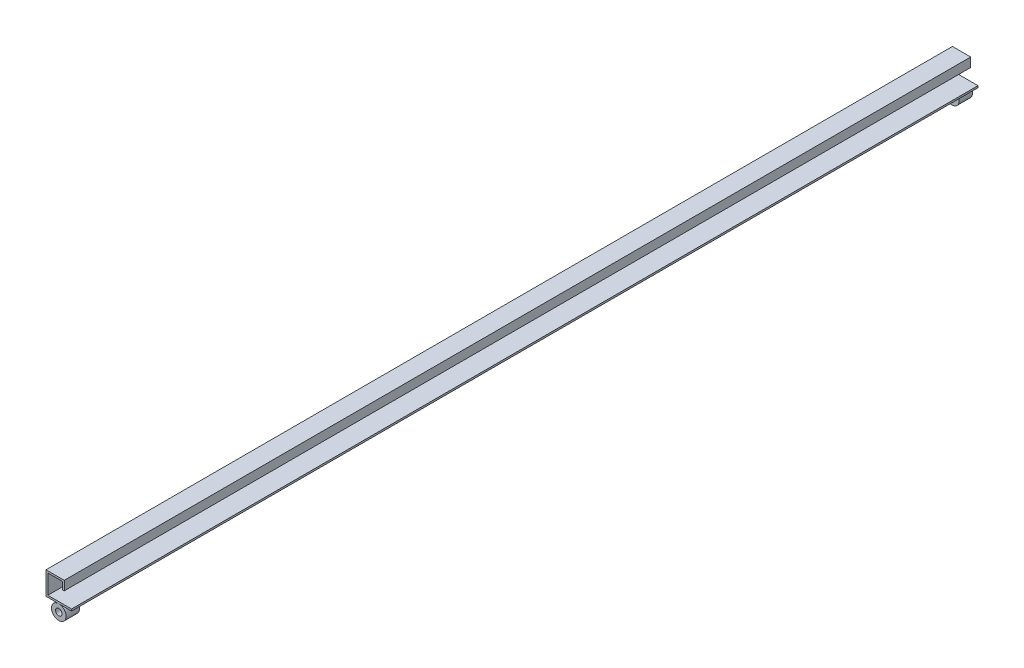
ISO-10303-21;
HEADER;
FILE_DESCRIPTION(('STEP AP214'),'2;1');
FILE_NAME('part.step','',(''),(''),'','','');
FILE_SCHEMA(('AUTOMOTIVE_DESIGN { 1 0 10303 214 1 1 1 1 }'));
ENDSEC;
DATA;
#1=APPLICATION_CONTEXT('core data for automotive mechanical design processes');
#2=APPLICATION_PROTOCOL_DEFINITION('international standard','automotive_design',2000,#1);
#3=PRODUCT_CONTEXT('',#1,'mechanical');
#4=PRODUCT('Part','Part','',(#3));
#5=PRODUCT_RELATED_PRODUCT_CATEGORY('part','',(#4));
#6=PRODUCT_DEFINITION_FORMATION('','',#4);
#7=PRODUCT_DEFINITION_CONTEXT('part definition',#1,'design');
#8=PRODUCT_DEFINITION('design','',#6,#7);
#9=PRODUCT_DEFINITION_SHAPE('','',#8);
#10=(LENGTH_UNIT() NAMED_UNIT(*) SI_UNIT(.MILLI.,.METRE.));
#11=(NAMED_UNIT(*) PLANE_ANGLE_UNIT() SI_UNIT($,.RADIAN.));
#12=(NAMED_UNIT(*) SI_UNIT($,.STERADIAN.) SOLID_ANGLE_UNIT());
#13=UNCERTAINTY_MEASURE_WITH_UNIT(LENGTH_MEASURE(1.E-05),#10,'distance_accuracy_value','');
#14=(GEOMETRIC_REPRESENTATION_CONTEXT(3) GLOBAL_UNCERTAINTY_ASSIGNED_CONTEXT((#13)) GLOBAL_UNIT_ASSIGNED_CONTEXT((#10,
#11,#12)) REPRESENTATION_CONTEXT('',''));
#15=CARTESIAN_POINT('',(0.,0.,0.));
#16=DIRECTION('',(0.,0.,1.));
#17=DIRECTION('',(1.,0.,0.));
#18=AXIS2_PLACEMENT_3D('',#15,#16,#17);
#19=CARTESIAN_POINT('',(-14.,-8.,978.4));
#20=DIRECTION('',(0.,0.,1.));
#21=DIRECTION('',(-1.,0.,0.));
#22=AXIS2_PLACEMENT_3D('',#19,#20,#21);
#23=CYLINDRICAL_SURFACE('',#22,8.);
#24=CARTESIAN_POINT('',(-14.,-8.,978.4));
#25=DIRECTION('',(0.,0.,-1.));
#26=DIRECTION('',(-1.,0.,0.));
#27=AXIS2_PLACEMENT_3D('',#24,#25,#26);
#28=CIRCLE('',#27,8.);
#29=CARTESIAN_POINT('',(-22.,-8.,978.4));
#30=VERTEX_POINT('',#29);
#31=EDGE_CURVE('E11',#30,#30,#28,.T.);
#32=ORIENTED_EDGE('',*,*,#31,.F.);
#33=EDGE_LOOP('',(#32));
#34=FACE_BOUND('',#33,.T.);
#35=CARTESIAN_POINT('',(-14.,-8.,993.));
#36=DIRECTION('',(0.,0.,-1.));
#37=DIRECTION('',(-1.,0.,0.));
#38=AXIS2_PLACEMENT_3D('',#35,#36,#37);
#39=CIRCLE('',#38,8.);
#40=CARTESIAN_POINT('',(-22.,-8.,993.));
#41=VERTEX_POINT('',#40);
#42=EDGE_CURVE('E46',#41,#41,#39,.T.);
#43=ORIENTED_EDGE('',*,*,#42,.T.);
#44=EDGE_LOOP('',(#43));
#45=FACE_BOUND('',#44,.T.);
#46=ADVANCED_FACE('F43',(#34,#45),#23,.T.);
#47=CARTESIAN_POINT('',(-14.,-8.,978.4));
#48=DIRECTION('',(0.,0.,1.));
#49=DIRECTION('',(-1.,0.,0.));
#50=AXIS2_PLACEMENT_3D('',#47,#48,#49);
#51=PLANE('',#50);
#52=CARTESIAN_POINT('',(-14.,-8.,978.4));
#53=DIRECTION('',(0.,0.,-1.));
#54=DIRECTION('',(-1.,0.,0.));
#55=AXIS2_PLACEMENT_3D('',#52,#53,#54);
#56=CIRCLE('',#55,3.5);
#57=CARTESIAN_POINT('',(-17.5,-8.,978.4));
#58=VERTEX_POINT('',#57);
#59=EDGE_CURVE('E53',#58,#58,#56,.T.);
#60=ORIENTED_EDGE('',*,*,#59,.F.);
#61=EDGE_LOOP('',(#60));
#62=FACE_BOUND('',#61,.T.);
#63=ORIENTED_EDGE('',*,*,#31,.T.);
#64=EDGE_LOOP('',(#63));
#65=FACE_BOUND('',#64,.T.);
#66=ADVANCED_FACE('F64',(#62,#65),#51,.F.);
#67=CARTESIAN_POINT('',(-14.,-8.,993.));
#68=DIRECTION('',(0.,0.,1.));
#69=DIRECTION('',(-1.,0.,0.));
#70=AXIS2_PLACEMENT_3D('',#67,#68,#69);
#71=PLANE('',#70);
#72=CARTESIAN_POINT('',(-14.,-8.,993.));
#73=DIRECTION('',(0.,0.,-1.));
#74=DIRECTION('',(-1.,0.,0.));
#75=AXIS2_PLACEMENT_3D('',#72,#73,#74);
#76=CIRCLE('',#75,3.5);
#77=CARTESIAN_POINT('',(-17.5,-8.,993.));
#78=VERTEX_POINT('',#77);
#79=EDGE_CURVE('E55',#78,#78,#76,.T.);
#80=ORIENTED_EDGE('',*,*,#79,.T.);
#81=EDGE_LOOP('',(#80));
#82=FACE_BOUND('',#81,.T.);
#83=ORIENTED_EDGE('',*,*,#42,.F.);
#84=EDGE_LOOP('',(#83));
#85=FACE_BOUND('',#84,.T.);
#86=ADVANCED_FACE('F66',(#82,#85),#71,.T.);
#87=CARTESIAN_POINT('',(-14.,-8.,978.4));
#88=DIRECTION('',(0.,0.,1.));
#89=DIRECTION('',(-1.,0.,0.));
#90=AXIS2_PLACEMENT_3D('',#87,#88,#89);
#91=CYLINDRICAL_SURFACE('',#90,3.5);
#92=ORIENTED_EDGE('',*,*,#59,.T.);
#93=EDGE_LOOP('',(#92));
#94=FACE_BOUND('',#93,.T.);
#95=ORIENTED_EDGE('',*,*,#79,.F.);
#96=EDGE_LOOP('',(#95));
#97=FACE_BOUND('',#96,.T.);
#98=ADVANCED_FACE('F61',(#94,#97),#91,.F.);
#99=CLOSED_SHELL('',(#46,#66,#86,#98));
#100=MANIFOLD_SOLID_BREP('B2',#99);
#101=CARTESIAN_POINT('',(-14.,-8.,14.6));
#102=DIRECTION('',(0.,0.,-1.));
#103=DIRECTION('',(-1.,0.,0.));
#104=AXIS2_PLACEMENT_3D('',#101,#102,#103);
#105=CYLINDRICAL_SURFACE('',#104,8.);
#106=CARTESIAN_POINT('',(-14.,-8.,14.6));
#107=DIRECTION('',(0.,0.,-1.));
#108=DIRECTION('',(-1.,0.,0.));
#109=AXIS2_PLACEMENT_3D('',#106,#107,#108);
#110=CIRCLE('',#109,8.);
#111=CARTESIAN_POINT('',(-22.,-8.,14.6));
#112=VERTEX_POINT('',#111);
#113=EDGE_CURVE('E42',#112,#112,#110,.T.);
#114=ORIENTED_EDGE('',*,*,#113,.T.);
#115=EDGE_LOOP('',(#114));
#116=FACE_BOUND('',#115,.T.);
#117=CARTESIAN_POINT('',(-14.,-8.,0.));
#118=DIRECTION('',(0.,0.,-1.));
#119=DIRECTION('',(-1.,0.,0.));
#120=AXIS2_PLACEMENT_3D('',#117,#118,#119);
#121=CIRCLE('',#120,8.);
#122=CARTESIAN_POINT('',(-22.,-8.,0.));
#123=VERTEX_POINT('',#122);
#124=EDGE_CURVE('E124',#123,#123,#121,.T.);
#125=ORIENTED_EDGE('',*,*,#124,.F.);
#126=EDGE_LOOP('',(#125));
#127=FACE_BOUND('',#126,.T.);
#128=ADVANCED_FACE('F121',(#116,#127),#105,.T.);
#129=CARTESIAN_POINT('',(-14.,-8.,14.6));
#130=DIRECTION('',(0.,0.,-1.));
#131=DIRECTION('',(-1.,0.,0.));
#132=AXIS2_PLACEMENT_3D('',#129,#130,#131);
#133=PLANE('',#132);
#134=CARTESIAN_POINT('',(-14.,-8.,14.6));
#135=DIRECTION('',(0.,0.,-1.));
#136=DIRECTION('',(-1.,0.,0.));
#137=AXIS2_PLACEMENT_3D('',#134,#135,#136);
#138=CIRCLE('',#137,3.5);
#139=CARTESIAN_POINT('',(-17.5,-8.,14.6));
#140=VERTEX_POINT('',#139);
#141=EDGE_CURVE('E131',#140,#140,#138,.T.);
#142=ORIENTED_EDGE('',*,*,#141,.T.);
#143=EDGE_LOOP('',(#142));
#144=FACE_BOUND('',#143,.T.);
#145=ORIENTED_EDGE('',*,*,#113,.F.);
#146=EDGE_LOOP('',(#145));
#147=FACE_BOUND('',#146,.T.);
#148=ADVANCED_FACE('F139',(#144,#147),#133,.F.);
#149=CARTESIAN_POINT('',(-14.,-8.,0.));
#150=DIRECTION('',(0.,0.,-1.));
#151=DIRECTION('',(-1.,0.,0.));
#152=AXIS2_PLACEMENT_3D('',#149,#150,#151);
#153=PLANE('',#152);
#154=CARTESIAN_POINT('',(-14.,-8.,0.));
#155=DIRECTION('',(0.,0.,-1.));
#156=DIRECTION('',(-1.,0.,0.));
#157=AXIS2_PLACEMENT_3D('',#154,#155,#156);
#158=CIRCLE('',#157,3.5);
#159=CARTESIAN_POINT('',(-17.5,-8.,0.));
#160=VERTEX_POINT('',#159);
#161=EDGE_CURVE('E133',#160,#160,#158,.T.);
#162=ORIENTED_EDGE('',*,*,#161,.F.);
#163=EDGE_LOOP('',(#162));
#164=FACE_BOUND('',#163,.T.);
#165=ORIENTED_EDGE('',*,*,#124,.T.);
#166=EDGE_LOOP('',(#165));
#167=FACE_BOUND('',#166,.T.);
#168=ADVANCED_FACE('F145',(#164,#167),#153,.T.);
#169=CARTESIAN_POINT('',(-14.,-8.,14.6));
#170=DIRECTION('',(0.,0.,-1.));
#171=DIRECTION('',(-1.,0.,0.));
#172=AXIS2_PLACEMENT_3D('',#169,#170,#171);
#173=CYLINDRICAL_SURFACE('',#172,3.5);
#174=ORIENTED_EDGE('',*,*,#141,.F.);
#175=EDGE_LOOP('',(#174));
#176=FACE_BOUND('',#175,.T.);
#177=ORIENTED_EDGE('',*,*,#161,.T.);
#178=EDGE_LOOP('',(#177));
#179=FACE_BOUND('',#178,.T.);
#180=ADVANCED_FACE('F142',(#176,#179),#173,.F.);
#181=CLOSED_SHELL('',(#128,#148,#168,#180));
#182=MANIFOLD_SOLID_BREP('B6',#181);
#183=CARTESIAN_POINT('',(0.,2.,993.));
#184=DIRECTION('',(-1.,0.,0.));
#185=DIRECTION('',(0.,0.,1.));
#186=AXIS2_PLACEMENT_3D('',#183,#184,#185);
#187=PLANE('',#186);
#188=DIRECTION('',(0.,1.,0.));
#189=VECTOR('',#188,1.);
#190=CARTESIAN_POINT('',(0.,2.,0.));
#191=LINE('',#190,#189);
#192=CARTESIAN_POINT('',(0.,0.,0.));
#193=VERTEX_POINT('',#192);
#194=CARTESIAN_POINT('',(0.,2.,0.));
#195=VERTEX_POINT('',#194);
#196=EDGE_CURVE('E298',#193,#195,#191,.T.);
#197=ORIENTED_EDGE('',*,*,#196,.T.);
#198=DIRECTION('',(0.,0.,-1.));
#199=VECTOR('',#198,1.);
#200=CARTESIAN_POINT('',(0.,2.,993.));
#201=LINE('',#200,#199);
#202=CARTESIAN_POINT('',(0.,2.,993.));
#203=VERTEX_POINT('',#202);
#204=EDGE_CURVE('E119',#203,#195,#201,.T.);
#205=ORIENTED_EDGE('',*,*,#204,.F.);
#206=DIRECTION('',(0.,1.,0.));
#207=VECTOR('',#206,1.);
#208=CARTESIAN_POINT('',(0.,2.,993.));
#209=LINE('',#208,#207);
#210=CARTESIAN_POINT('',(0.,0.,993.));
#211=VERTEX_POINT('',#210);
#212=EDGE_CURVE('E316',#211,#203,#209,.T.);
#213=ORIENTED_EDGE('',*,*,#212,.F.);
#214=DIRECTION('',(0.,0.,-1.));
#215=VECTOR('',#214,1.);
#216=CARTESIAN_POINT('',(0.,0.,993.));
#217=LINE('',#216,#215);
#218=EDGE_CURVE('E294',#211,#193,#217,.T.);
#219=ORIENTED_EDGE('',*,*,#218,.T.);
#220=EDGE_LOOP('',(#197,#205,#213,#219));
#221=FACE_BOUND('',#220,.T.);
#222=ADVANCED_FACE('F190',(#221),#187,.F.);
#223=CARTESIAN_POINT('',(0.,2.,993.));
#224=DIRECTION('',(0.,-1.,0.));
#225=DIRECTION('',(0.,0.,-1.));
#226=AXIS2_PLACEMENT_3D('',#223,#224,#225);
#227=PLANE('',#226);
#228=DIRECTION('',(-1.,0.,0.));
#229=VECTOR('',#228,1.);
#230=CARTESIAN_POINT('',(0.,2.,0.));
#231=LINE('',#230,#229);
#232=CARTESIAN_POINT('',(-26.,2.,0.));
#233=VERTEX_POINT('',#232);
#234=EDGE_CURVE('E301',#195,#233,#231,.T.);
#235=ORIENTED_EDGE('',*,*,#234,.T.);
#236=DIRECTION('',(0.,0.,-1.));
#237=VECTOR('',#236,1.);
#238=CARTESIAN_POINT('',(-26.,2.,993.));
#239=LINE('',#238,#237);
#240=CARTESIAN_POINT('',(-26.,2.,993.));
#241=VERTEX_POINT('',#240);
#242=EDGE_CURVE('E198',#241,#233,#239,.T.);
#243=ORIENTED_EDGE('',*,*,#242,.F.);
#244=DIRECTION('',(-1.,0.,0.));
#245=VECTOR('',#244,1.);
#246=CARTESIAN_POINT('',(0.,2.,993.));
#247=LINE('',#246,#245);
#248=EDGE_CURVE('E255',#203,#241,#247,.T.);
#249=ORIENTED_EDGE('',*,*,#248,.F.);
#250=ORIENTED_EDGE('',*,*,#204,.T.);
#251=EDGE_LOOP('',(#235,#243,#249,#250));
#252=FACE_BOUND('',#251,.T.);
#253=ADVANCED_FACE('F365',(#252),#227,.F.);
#254=CARTESIAN_POINT('',(-26.,2.,993.));
#255=DIRECTION('',(-1.,0.,0.));
#256=DIRECTION('',(0.,0.,1.));
#257=AXIS2_PLACEMENT_3D('',#254,#255,#256);
#258=PLANE('',#257);
#259=DIRECTION('',(0.,1.,0.));
#260=VECTOR('',#259,1.);
#261=CARTESIAN_POINT('',(-26.,2.,0.));
#262=LINE('',#261,#260);
#263=CARTESIAN_POINT('',(-26.,23.2,0.));
#264=VERTEX_POINT('',#263);
#265=EDGE_CURVE('E303',#233,#264,#262,.T.);
#266=ORIENTED_EDGE('',*,*,#265,.T.);
#267=DIRECTION('',(0.,0.,-1.));
#268=VECTOR('',#267,1.);
#269=CARTESIAN_POINT('',(-26.,23.2,993.));
#270=LINE('',#269,#268);
#271=CARTESIAN_POINT('',(-26.,23.2,993.));
#272=VERTEX_POINT('',#271);
#273=EDGE_CURVE('E329',#272,#264,#270,.T.);
#274=ORIENTED_EDGE('',*,*,#273,.F.);
#275=DIRECTION('',(0.,1.,0.));
#276=VECTOR('',#275,1.);
#277=CARTESIAN_POINT('',(-26.,2.,993.));
#278=LINE('',#277,#276);
#279=EDGE_CURVE('E337',#241,#272,#278,.T.);
#280=ORIENTED_EDGE('',*,*,#279,.F.);
#281=ORIENTED_EDGE('',*,*,#242,.T.);
#282=EDGE_LOOP('',(#266,#274,#280,#281));
#283=FACE_BOUND('',#282,.T.);
#284=ADVANCED_FACE('F335',(#283),#258,.F.);
#285=CARTESIAN_POINT('',(-26.,23.2,993.));
#286=DIRECTION('',(0.,1.,0.));
#287=DIRECTION('',(0.,0.,1.));
#288=AXIS2_PLACEMENT_3D('',#285,#286,#287);
#289=PLANE('',#288);
#290=DIRECTION('',(1.,0.,0.));
#291=VECTOR('',#290,1.);
#292=CARTESIAN_POINT('',(-26.,23.2,0.));
#293=LINE('',#292,#291);
#294=CARTESIAN_POINT('',(-10.,23.2,0.));
#295=VERTEX_POINT('',#294);
#296=EDGE_CURVE('E305',#264,#295,#293,.T.);
#297=ORIENTED_EDGE('',*,*,#296,.T.);
#298=DIRECTION('',(0.,0.,-1.));
#299=VECTOR('',#298,1.);
#300=CARTESIAN_POINT('',(-10.,23.2,993.));
#301=LINE('',#300,#299);
#302=CARTESIAN_POINT('',(-10.,23.2,993.));
#303=VERTEX_POINT('',#302);
#304=EDGE_CURVE('E326',#303,#295,#301,.T.);
#305=ORIENTED_EDGE('',*,*,#304,.F.);
#306=DIRECTION('',(1.,0.,0.));
#307=VECTOR('',#306,1.);
#308=CARTESIAN_POINT('',(-26.,23.2,993.));
#309=LINE('',#308,#307);
#310=EDGE_CURVE('E355',#272,#303,#309,.T.);
#311=ORIENTED_EDGE('',*,*,#310,.F.);
#312=ORIENTED_EDGE('',*,*,#273,.T.);
#313=EDGE_LOOP('',(#297,#305,#311,#312));
#314=FACE_BOUND('',#313,.T.);
#315=ADVANCED_FACE('F346',(#314),#289,.F.);
#316=CARTESIAN_POINT('',(-10.,23.2,993.));
#317=DIRECTION('',(1.,0.,0.));
#318=DIRECTION('',(0.,0.,-1.));
#319=AXIS2_PLACEMENT_3D('',#316,#317,#318);
#320=PLANE('',#319);
#321=DIRECTION('',(0.,-1.,0.));
#322=VECTOR('',#321,1.);
#323=CARTESIAN_POINT('',(-10.,23.2,0.));
#324=LINE('',#323,#322);
#325=CARTESIAN_POINT('',(-10.,15.2,0.));
#326=VERTEX_POINT('',#325);
#327=EDGE_CURVE('E307',#295,#326,#324,.T.);
#328=ORIENTED_EDGE('',*,*,#327,.T.);
#329=DIRECTION('',(0.,0.,-1.));
#330=VECTOR('',#329,1.);
#331=CARTESIAN_POINT('',(-10.,15.2,993.));
#332=LINE('',#331,#330);
#333=CARTESIAN_POINT('',(-10.,15.2,993.));
#334=VERTEX_POINT('',#333);
#335=EDGE_CURVE('E323',#334,#326,#332,.T.);
#336=ORIENTED_EDGE('',*,*,#335,.F.);
#337=DIRECTION('',(0.,-1.,0.));
#338=VECTOR('',#337,1.);
#339=CARTESIAN_POINT('',(-10.,23.2,993.));
#340=LINE('',#339,#338);
#341=EDGE_CURVE('E352',#303,#334,#340,.T.);
#342=ORIENTED_EDGE('',*,*,#341,.F.);
#343=ORIENTED_EDGE('',*,*,#304,.T.);
#344=EDGE_LOOP('',(#328,#336,#342,#343));
#345=FACE_BOUND('',#344,.T.);
#346=ADVANCED_FACE('F350',(#345),#320,.F.);
#347=CARTESIAN_POINT('',(-10.,15.2,993.));
#348=DIRECTION('',(0.,1.,0.));
#349=DIRECTION('',(0.,0.,1.));
#350=AXIS2_PLACEMENT_3D('',#347,#348,#349);
#351=PLANE('',#350);
#352=DIRECTION('',(1.,0.,0.));
#353=VECTOR('',#352,1.);
#354=CARTESIAN_POINT('',(-10.,15.2,0.));
#355=LINE('',#354,#353);
#356=CARTESIAN_POINT('',(-8.,15.2,0.));
#357=VERTEX_POINT('',#356);
#358=EDGE_CURVE('E309',#326,#357,#355,.T.);
#359=ORIENTED_EDGE('',*,*,#358,.T.);
#360=DIRECTION('',(0.,0.,-1.));
#361=VECTOR('',#360,1.);
#362=CARTESIAN_POINT('',(-8.,15.2,993.));
#363=LINE('',#362,#361);
#364=CARTESIAN_POINT('',(-8.,15.2,993.));
#365=VERTEX_POINT('',#364);
#366=EDGE_CURVE('E320',#365,#357,#363,.T.);
#367=ORIENTED_EDGE('',*,*,#366,.F.);
#368=DIRECTION('',(1.,0.,0.));
#369=VECTOR('',#368,1.);
#370=CARTESIAN_POINT('',(-10.,15.2,993.));
#371=LINE('',#370,#369);
#372=EDGE_CURVE('E354',#334,#365,#371,.T.);
#373=ORIENTED_EDGE('',*,*,#372,.F.);
#374=ORIENTED_EDGE('',*,*,#335,.T.);
#375=EDGE_LOOP('',(#359,#367,#373,#374));
#376=FACE_BOUND('',#375,.T.);
#377=ADVANCED_FACE('F377',(#376),#351,.F.);
#378=CARTESIAN_POINT('',(-8.,25.2,993.));
#379=DIRECTION('',(-1.,0.,0.));
#380=DIRECTION('',(0.,-1.,0.));
#381=AXIS2_PLACEMENT_3D('',#378,#379,#380);
#382=PLANE('',#381);
#383=DIRECTION('',(0.,1.,0.));
#384=VECTOR('',#383,1.);
#385=CARTESIAN_POINT('',(-8.,25.2,0.));
#386=LINE('',#385,#384);
#387=CARTESIAN_POINT('',(-8.,25.2,0.));
#388=VERTEX_POINT('',#387);
#389=EDGE_CURVE('E311',#357,#388,#386,.T.);
#390=ORIENTED_EDGE('',*,*,#389,.T.);
#391=DIRECTION('',(0.,0.,-1.));
#392=VECTOR('',#391,1.);
#393=CARTESIAN_POINT('',(-8.,25.2,993.));
#394=LINE('',#393,#392);
#395=CARTESIAN_POINT('',(-8.,25.2,993.));
#396=VERTEX_POINT('',#395);
#397=EDGE_CURVE('E289',#396,#388,#394,.T.);
#398=ORIENTED_EDGE('',*,*,#397,.F.);
#399=DIRECTION('',(0.,1.,0.));
#400=VECTOR('',#399,1.);
#401=CARTESIAN_POINT('',(-8.,25.2,993.));
#402=LINE('',#401,#400);
#403=EDGE_CURVE('E280',#365,#396,#402,.T.);
#404=ORIENTED_EDGE('',*,*,#403,.F.);
#405=ORIENTED_EDGE('',*,*,#366,.T.);
#406=EDGE_LOOP('',(#390,#398,#404,#405));
#407=FACE_BOUND('',#406,.T.);
#408=ADVANCED_FACE('F380',(#407),#382,.F.);
#409=CARTESIAN_POINT('',(-28.,25.2,993.));
#410=DIRECTION('',(0.,-1.,0.));
#411=DIRECTION('',(0.,0.,-1.));
#412=AXIS2_PLACEMENT_3D('',#409,#410,#411);
#413=PLANE('',#412);
#414=DIRECTION('',(-1.,0.,0.));
#415=VECTOR('',#414,1.);
#416=CARTESIAN_POINT('',(-28.,25.2,0.));
#417=LINE('',#416,#415);
#418=CARTESIAN_POINT('',(-28.,25.2,0.));
#419=VERTEX_POINT('',#418);
#420=EDGE_CURVE('E288',#388,#419,#417,.T.);
#421=ORIENTED_EDGE('',*,*,#420,.T.);
#422=DIRECTION('',(0.,0.,-1.));
#423=VECTOR('',#422,1.);
#424=CARTESIAN_POINT('',(-28.,25.2,993.));
#425=LINE('',#424,#423);
#426=CARTESIAN_POINT('',(-28.,25.2,993.));
#427=VERTEX_POINT('',#426);
#428=EDGE_CURVE('E285',#427,#419,#425,.T.);
#429=ORIENTED_EDGE('',*,*,#428,.F.);
#430=DIRECTION('',(-1.,0.,0.));
#431=VECTOR('',#430,1.);
#432=CARTESIAN_POINT('',(-28.,25.2,993.));
#433=LINE('',#432,#431);
#434=EDGE_CURVE('E274',#396,#427,#433,.T.);
#435=ORIENTED_EDGE('',*,*,#434,.F.);
#436=ORIENTED_EDGE('',*,*,#397,.T.);
#437=EDGE_LOOP('',(#421,#429,#435,#436));
#438=FACE_BOUND('',#437,.T.);
#439=ADVANCED_FACE('F286',(#438),#413,.F.);
#440=CARTESIAN_POINT('',(-28.,0.,993.));
#441=DIRECTION('',(1.,0.,0.));
#442=DIRECTION('',(0.,0.,-1.));
#443=AXIS2_PLACEMENT_3D('',#440,#441,#442);
#444=PLANE('',#443);
#445=DIRECTION('',(0.,-1.,0.));
#446=VECTOR('',#445,1.);
#447=CARTESIAN_POINT('',(-28.,0.,0.));
#448=LINE('',#447,#446);
#449=CARTESIAN_POINT('',(-28.,0.,0.));
#450=VERTEX_POINT('',#449);
#451=EDGE_CURVE('E241',#419,#450,#448,.T.);
#452=ORIENTED_EDGE('',*,*,#451,.T.);
#453=DIRECTION('',(0.,0.,-1.));
#454=VECTOR('',#453,1.);
#455=CARTESIAN_POINT('',(-28.,0.,993.));
#456=LINE('',#455,#454);
#457=CARTESIAN_POINT('',(-28.,0.,993.));
#458=VERTEX_POINT('',#457);
#459=EDGE_CURVE('E290',#458,#450,#456,.T.);
#460=ORIENTED_EDGE('',*,*,#459,.F.);
#461=DIRECTION('',(0.,-1.,0.));
#462=VECTOR('',#461,1.);
#463=CARTESIAN_POINT('',(-28.,0.,993.));
#464=LINE('',#463,#462);
#465=EDGE_CURVE('E278',#427,#458,#464,.T.);
#466=ORIENTED_EDGE('',*,*,#465,.F.);
#467=ORIENTED_EDGE('',*,*,#428,.T.);
#468=EDGE_LOOP('',(#452,#460,#466,#467));
#469=FACE_BOUND('',#468,.T.);
#470=ADVANCED_FACE('F292',(#469),#444,.F.);
#471=CARTESIAN_POINT('',(0.,0.,993.));
#472=DIRECTION('',(0.,1.,0.));
#473=DIRECTION('',(-1.,0.,0.));
#474=AXIS2_PLACEMENT_3D('',#471,#472,#473);
#475=PLANE('',#474);
#476=DIRECTION('',(1.,0.,0.));
#477=VECTOR('',#476,1.);
#478=CARTESIAN_POINT('',(0.,0.,0.));
#479=LINE('',#478,#477);
#480=EDGE_CURVE('E247',#450,#193,#479,.T.);
#481=ORIENTED_EDGE('',*,*,#480,.T.);
#482=ORIENTED_EDGE('',*,*,#218,.F.);
#483=DIRECTION('',(1.,0.,0.));
#484=VECTOR('',#483,1.);
#485=CARTESIAN_POINT('',(0.,0.,993.));
#486=LINE('',#485,#484);
#487=EDGE_CURVE('E206',#458,#211,#486,.T.);
#488=ORIENTED_EDGE('',*,*,#487,.F.);
#489=ORIENTED_EDGE('',*,*,#459,.T.);
#490=EDGE_LOOP('',(#481,#482,#488,#489));
#491=FACE_BOUND('',#490,.T.);
#492=ADVANCED_FACE('F389',(#491),#475,.F.);
#493=CARTESIAN_POINT('',(0.,0.,993.));
#494=DIRECTION('',(0.,0.,-1.));
#495=DIRECTION('',(-1.,0.,0.));
#496=AXIS2_PLACEMENT_3D('',#493,#494,#495);
#497=PLANE('',#496);
#498=ORIENTED_EDGE('',*,*,#212,.T.);
#499=ORIENTED_EDGE('',*,*,#248,.T.);
#500=ORIENTED_EDGE('',*,*,#279,.T.);
#501=ORIENTED_EDGE('',*,*,#310,.T.);
#502=ORIENTED_EDGE('',*,*,#341,.T.);
#503=ORIENTED_EDGE('',*,*,#372,.T.);
#504=ORIENTED_EDGE('',*,*,#403,.T.);
#505=ORIENTED_EDGE('',*,*,#434,.T.);
#506=ORIENTED_EDGE('',*,*,#465,.T.);
#507=ORIENTED_EDGE('',*,*,#487,.T.);
#508=EDGE_LOOP('',(#498,#499,#500,#501,#502,#503,#504,#505,#506,#507));
#509=FACE_BOUND('',#508,.T.);
#510=ADVANCED_FACE('F276',(#509),#497,.F.);
#511=CARTESIAN_POINT('',(0.,0.,0.));
#512=DIRECTION('',(0.,0.,-1.));
#513=DIRECTION('',(-1.,0.,0.));
#514=AXIS2_PLACEMENT_3D('',#511,#512,#513);
#515=PLANE('',#514);
#516=ORIENTED_EDGE('',*,*,#196,.F.);
#517=ORIENTED_EDGE('',*,*,#480,.F.);
#518=ORIENTED_EDGE('',*,*,#451,.F.);
#519=ORIENTED_EDGE('',*,*,#420,.F.);
#520=ORIENTED_EDGE('',*,*,#389,.F.);
#521=ORIENTED_EDGE('',*,*,#358,.F.);
#522=ORIENTED_EDGE('',*,*,#327,.F.);
#523=ORIENTED_EDGE('',*,*,#296,.F.);
#524=ORIENTED_EDGE('',*,*,#265,.F.);
#525=ORIENTED_EDGE('',*,*,#234,.F.);
#526=EDGE_LOOP('',(#516,#517,#518,#519,#520,#521,#522,#523,#524,#525));
#527=FACE_BOUND('',#526,.T.);
#528=ADVANCED_FACE('F341',(#527),#515,.T.);
#529=CLOSED_SHELL('',(#222,#253,#284,#315,#346,#377,#408,#439,#470,#492,#510,#528));
#530=MANIFOLD_SOLID_BREP('B37',#529);
#531=ADVANCED_BREP_SHAPE_REPRESENTATION('',(#18,#100,#182,#530),#14);
#532=SHAPE_DEFINITION_REPRESENTATION(#9,#531);
ENDSEC;
END-ISO-10303-21;
